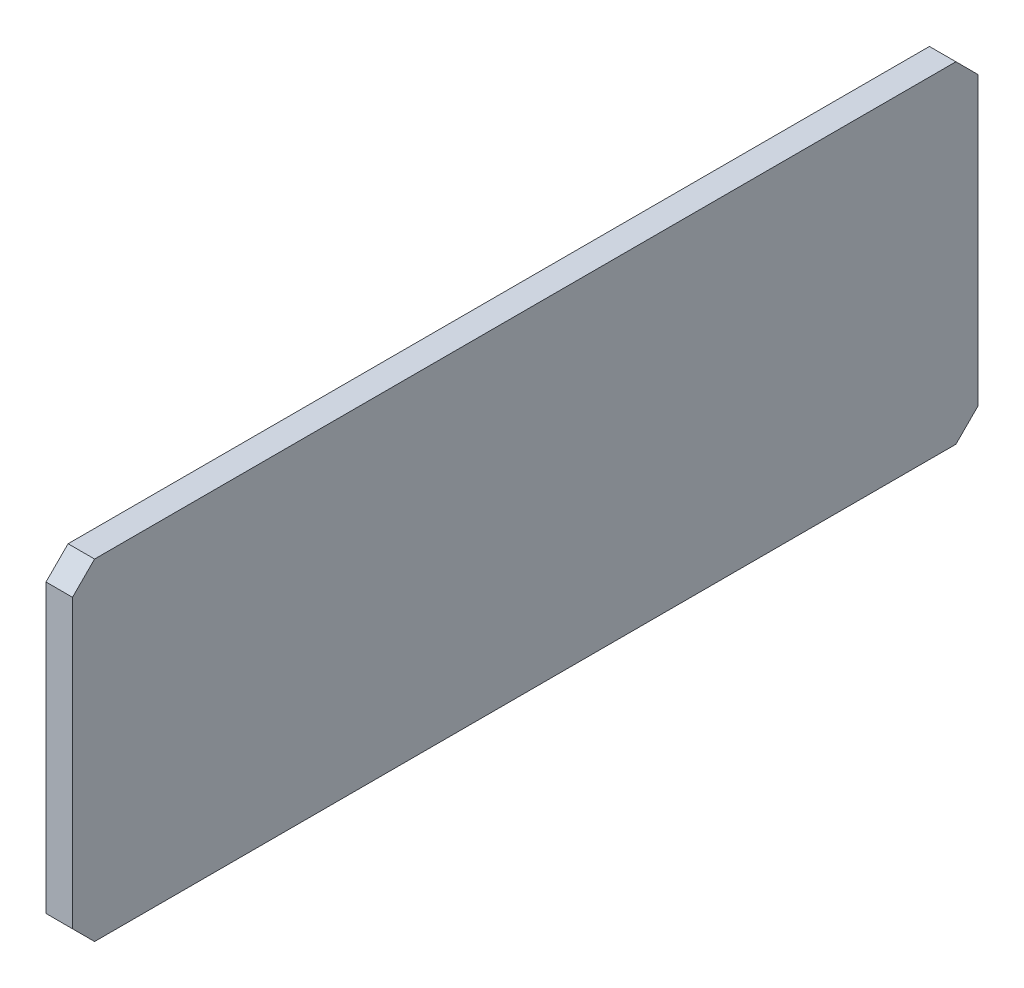
ISO-10303-21;
HEADER;
FILE_DESCRIPTION(('STEP AP214'),'2;1');
FILE_NAME('part.step','',(''),(''),'','','');
FILE_SCHEMA(('AUTOMOTIVE_DESIGN { 1 0 10303 214 1 1 1 1 }'));
ENDSEC;
DATA;
#1=APPLICATION_CONTEXT('core data for automotive mechanical design processes');
#2=APPLICATION_PROTOCOL_DEFINITION('international standard','automotive_design',2000,#1);
#3=PRODUCT_CONTEXT('',#1,'mechanical');
#4=PRODUCT('Part','Part','',(#3));
#5=PRODUCT_RELATED_PRODUCT_CATEGORY('part','',(#4));
#6=PRODUCT_DEFINITION_FORMATION('','',#4);
#7=PRODUCT_DEFINITION_CONTEXT('part definition',#1,'design');
#8=PRODUCT_DEFINITION('design','',#6,#7);
#9=PRODUCT_DEFINITION_SHAPE('','',#8);
#10=(LENGTH_UNIT() NAMED_UNIT(*) SI_UNIT(.MILLI.,.METRE.));
#11=(NAMED_UNIT(*) PLANE_ANGLE_UNIT() SI_UNIT($,.RADIAN.));
#12=(NAMED_UNIT(*) SI_UNIT($,.STERADIAN.) SOLID_ANGLE_UNIT());
#13=UNCERTAINTY_MEASURE_WITH_UNIT(LENGTH_MEASURE(1.E-05),#10,'distance_accuracy_value','');
#14=(GEOMETRIC_REPRESENTATION_CONTEXT(3) GLOBAL_UNCERTAINTY_ASSIGNED_CONTEXT((#13)) GLOBAL_UNIT_ASSIGNED_CONTEXT((#10,
#11,#12)) REPRESENTATION_CONTEXT('',''));
#15=CARTESIAN_POINT('',(0.,0.,0.));
#16=DIRECTION('',(0.,0.,1.));
#17=DIRECTION('',(1.,0.,0.));
#18=AXIS2_PLACEMENT_3D('',#15,#16,#17);
#19=CARTESIAN_POINT('',(5.99999999999978,-75.,410.000000000001));
#20=DIRECTION('',(-1.,0.,0.));
#21=DIRECTION('',(0.,0.,1.));
#22=AXIS2_PLACEMENT_3D('',#19,#20,#21);
#23=PLANE('',#22);
#24=DIRECTION('',(0.,1.,0.));
#25=VECTOR('',#24,1.);
#26=CARTESIAN_POINT('',(6.00000000000001,-75.,0.));
#27=LINE('',#26,#25);
#28=CARTESIAN_POINT('',(6.00000000000001,-64.9999999999999,0.));
#29=VERTEX_POINT('',#28);
#30=CARTESIAN_POINT('',(5.99999999999978,64.9999999999999,0.));
#31=VERTEX_POINT('',#30);
#32=EDGE_CURVE('E157',#29,#31,#27,.T.);
#33=ORIENTED_EDGE('',*,*,#32,.T.);
#34=DIRECTION('',(0.,0.70710678118655,0.707106781186546));
#35=VECTOR('',#34,1.);
#36=CARTESIAN_POINT('',(5.99999999999978,75.,10.));
#37=LINE('',#36,#35);
#38=CARTESIAN_POINT('',(5.99999999999978,75.,10.0000000000002));
#39=VERTEX_POINT('',#38);
#40=EDGE_CURVE('E142',#31,#39,#37,.T.);
#41=ORIENTED_EDGE('',*,*,#40,.T.);
#42=DIRECTION('',(0.,0.,-1.));
#43=VECTOR('',#42,1.);
#44=CARTESIAN_POINT('',(6.00000000000001,75.,410.000000000001));
#45=LINE('',#44,#43);
#46=CARTESIAN_POINT('',(6.00000000000001,75.,400.));
#47=VERTEX_POINT('',#46);
#48=EDGE_CURVE('E121',#47,#39,#45,.T.);
#49=ORIENTED_EDGE('',*,*,#48,.F.);
#50=DIRECTION('',(0.,0.707106781186546,-0.70710678118655));
#51=VECTOR('',#50,1.);
#52=CARTESIAN_POINT('',(6.00000000000001,64.9999999999999,410.000000000001));
#53=LINE('',#52,#51);
#54=CARTESIAN_POINT('',(6.00000000000001,64.9999999999999,410.000000000001));
#55=VERTEX_POINT('',#54);
#56=EDGE_CURVE('E125',#47,#55,#53,.F.);
#57=ORIENTED_EDGE('',*,*,#56,.T.);
#58=DIRECTION('',(0.,1.,0.));
#59=VECTOR('',#58,1.);
#60=CARTESIAN_POINT('',(5.99999999999978,-75.,410.000000000001));
#61=LINE('',#60,#59);
#62=CARTESIAN_POINT('',(5.99999999999978,-65.,410.000000000001));
#63=VERTEX_POINT('',#62);
#64=EDGE_CURVE('E151',#63,#55,#61,.T.);
#65=ORIENTED_EDGE('',*,*,#64,.F.);
#66=DIRECTION('',(0.,0.707106781186546,0.70710678118655));
#67=VECTOR('',#66,1.);
#68=CARTESIAN_POINT('',(5.99999999999978,-65.,410.000000000001));
#69=LINE('',#68,#67);
#70=CARTESIAN_POINT('',(5.99999999999978,-75.,400.));
#71=VERTEX_POINT('',#70);
#72=EDGE_CURVE('E57',#63,#71,#69,.F.);
#73=ORIENTED_EDGE('',*,*,#72,.T.);
#74=DIRECTION('',(0.,0.,-1.));
#75=VECTOR('',#74,1.);
#76=CARTESIAN_POINT('',(5.99999999999978,-75.,410.000000000001));
#77=LINE('',#76,#75);
#78=CARTESIAN_POINT('',(6.00000000000001,-75.,10.));
#79=VERTEX_POINT('',#78);
#80=EDGE_CURVE('E154',#71,#79,#77,.T.);
#81=ORIENTED_EDGE('',*,*,#80,.T.);
#82=DIRECTION('',(0.,0.70710678118655,-0.707106781186546));
#83=VECTOR('',#82,1.);
#84=CARTESIAN_POINT('',(6.00000000000001,-75.,10.));
#85=LINE('',#84,#83);
#86=EDGE_CURVE('E49',#79,#29,#85,.T.);
#87=ORIENTED_EDGE('',*,*,#86,.T.);
#88=EDGE_LOOP('',(#33,#41,#49,#57,#65,#73,#81,#87));
#89=FACE_BOUND('',#88,.T.);
#90=ADVANCED_FACE('F34',(#89),#23,.F.);
#91=CARTESIAN_POINT('',(-6.00000000000001,75.,410.000000000001));
#92=DIRECTION('',(0.,-1.,0.));
#93=DIRECTION('',(0.,0.,-1.));
#94=AXIS2_PLACEMENT_3D('',#91,#92,#93);
#95=PLANE('',#94);
#96=ORIENTED_EDGE('',*,*,#48,.T.);
#97=DIRECTION('',(-1.,0.,0.));
#98=VECTOR('',#97,1.);
#99=CARTESIAN_POINT('',(-6.00000000000023,75.,10.));
#100=LINE('',#99,#98);
#101=CARTESIAN_POINT('',(-6.00000000000023,75.,10.0000000000002));
#102=VERTEX_POINT('',#101);
#103=EDGE_CURVE('E112',#39,#102,#100,.T.);
#104=ORIENTED_EDGE('',*,*,#103,.T.);
#105=DIRECTION('',(0.,0.,-1.));
#106=VECTOR('',#105,1.);
#107=CARTESIAN_POINT('',(-6.00000000000001,75.,410.000000000001));
#108=LINE('',#107,#106);
#109=CARTESIAN_POINT('',(-6.00000000000001,75.,400.));
#110=VERTEX_POINT('',#109);
#111=EDGE_CURVE('E104',#110,#102,#108,.T.);
#112=ORIENTED_EDGE('',*,*,#111,.F.);
#113=DIRECTION('',(1.,0.,0.));
#114=VECTOR('',#113,1.);
#115=CARTESIAN_POINT('',(-6.00000000000001,75.,400.));
#116=LINE('',#115,#114);
#117=EDGE_CURVE('E118',#110,#47,#116,.T.);
#118=ORIENTED_EDGE('',*,*,#117,.T.);
#119=EDGE_LOOP('',(#96,#104,#112,#118));
#120=FACE_BOUND('',#119,.T.);
#121=ADVANCED_FACE('F117',(#120),#95,.F.);
#122=CARTESIAN_POINT('',(-6.00000000000012,-75.,410.000000000001));
#123=DIRECTION('',(1.,0.,0.));
#124=DIRECTION('',(0.,0.,-1.));
#125=AXIS2_PLACEMENT_3D('',#122,#123,#124);
#126=PLANE('',#125);
#127=ORIENTED_EDGE('',*,*,#111,.T.);
#128=DIRECTION('',(0.,-0.70710678118655,-0.707106781186546));
#129=VECTOR('',#128,1.);
#130=CARTESIAN_POINT('',(-6.00000000000023,75.,10.));
#131=LINE('',#130,#129);
#132=CARTESIAN_POINT('',(-6.00000000000023,64.9999999999999,0.));
#133=VERTEX_POINT('',#132);
#134=EDGE_CURVE('E133',#102,#133,#131,.T.);
#135=ORIENTED_EDGE('',*,*,#134,.T.);
#136=DIRECTION('',(0.,-1.,0.));
#137=VECTOR('',#136,1.);
#138=CARTESIAN_POINT('',(-6.00000000000001,-75.,0.));
#139=LINE('',#138,#137);
#140=CARTESIAN_POINT('',(-6.00000000000001,-64.9999999999999,0.));
#141=VERTEX_POINT('',#140);
#142=EDGE_CURVE('E152',#133,#141,#139,.T.);
#143=ORIENTED_EDGE('',*,*,#142,.T.);
#144=DIRECTION('',(0.,-0.70710678118655,0.707106781186546));
#145=VECTOR('',#144,1.);
#146=CARTESIAN_POINT('',(-6.00000000000001,-75.,10.));
#147=LINE('',#146,#145);
#148=CARTESIAN_POINT('',(-6.00000000000001,-75.,10.));
#149=VERTEX_POINT('',#148);
#150=EDGE_CURVE('E131',#141,#149,#147,.T.);
#151=ORIENTED_EDGE('',*,*,#150,.T.);
#152=DIRECTION('',(0.,0.,-1.));
#153=VECTOR('',#152,1.);
#154=CARTESIAN_POINT('',(-6.00000000000012,-75.,410.000000000001));
#155=LINE('',#154,#153);
#156=CARTESIAN_POINT('',(-6.00000000000012,-75.,400.));
#157=VERTEX_POINT('',#156);
#158=EDGE_CURVE('E122',#157,#149,#155,.T.);
#159=ORIENTED_EDGE('',*,*,#158,.F.);
#160=DIRECTION('',(0.,-0.707106781186546,-0.70710678118655));
#161=VECTOR('',#160,1.);
#162=CARTESIAN_POINT('',(-6.00000000000012,-65.,410.000000000001));
#163=LINE('',#162,#161);
#164=CARTESIAN_POINT('',(-6.00000000000012,-65.,410.000000000001));
#165=VERTEX_POINT('',#164);
#166=EDGE_CURVE('E111',#157,#165,#163,.F.);
#167=ORIENTED_EDGE('',*,*,#166,.T.);
#168=DIRECTION('',(0.,-1.,0.));
#169=VECTOR('',#168,1.);
#170=CARTESIAN_POINT('',(-6.00000000000012,-75.,410.000000000001));
#171=LINE('',#170,#169);
#172=CARTESIAN_POINT('',(-6.00000000000001,64.9999999999999,410.000000000001));
#173=VERTEX_POINT('',#172);
#174=EDGE_CURVE('E106',#173,#165,#171,.T.);
#175=ORIENTED_EDGE('',*,*,#174,.F.);
#176=DIRECTION('',(0.,-0.707106781186546,0.70710678118655));
#177=VECTOR('',#176,1.);
#178=CARTESIAN_POINT('',(-6.00000000000001,64.9999999999999,410.000000000001));
#179=LINE('',#178,#177);
#180=EDGE_CURVE('E101',#173,#110,#179,.F.);
#181=ORIENTED_EDGE('',*,*,#180,.T.);
#182=EDGE_LOOP('',(#127,#135,#143,#151,#159,#167,#175,#181));
#183=FACE_BOUND('',#182,.T.);
#184=ADVANCED_FACE('F103',(#183),#126,.F.);
#185=CARTESIAN_POINT('',(-6.00000000000012,-75.,410.000000000001));
#186=DIRECTION('',(0.,1.,0.));
#187=DIRECTION('',(0.,0.,1.));
#188=AXIS2_PLACEMENT_3D('',#185,#186,#187);
#189=PLANE('',#188);
#190=ORIENTED_EDGE('',*,*,#158,.T.);
#191=DIRECTION('',(1.,0.,0.));
#192=VECTOR('',#191,1.);
#193=CARTESIAN_POINT('',(6.00000000000001,-75.,10.));
#194=LINE('',#193,#192);
#195=EDGE_CURVE('E146',#149,#79,#194,.T.);
#196=ORIENTED_EDGE('',*,*,#195,.T.);
#197=ORIENTED_EDGE('',*,*,#80,.F.);
#198=DIRECTION('',(-1.,0.,0.));
#199=VECTOR('',#198,1.);
#200=CARTESIAN_POINT('',(-6.00000000000012,-75.,400.));
#201=LINE('',#200,#199);
#202=EDGE_CURVE('E144',#71,#157,#201,.T.);
#203=ORIENTED_EDGE('',*,*,#202,.T.);
#204=EDGE_LOOP('',(#190,#196,#197,#203));
#205=FACE_BOUND('',#204,.T.);
#206=ADVANCED_FACE('F166',(#205),#189,.F.);
#207=CARTESIAN_POINT('',(0.,0.,410.000000000001));
#208=DIRECTION('',(0.,0.,-1.));
#209=DIRECTION('',(-1.,0.,0.));
#210=AXIS2_PLACEMENT_3D('',#207,#208,#209);
#211=PLANE('',#210);
#212=ORIENTED_EDGE('',*,*,#174,.T.);
#213=DIRECTION('',(1.,0.,0.));
#214=VECTOR('',#213,1.);
#215=CARTESIAN_POINT('',(-2.22044604925031E-13,-65.,410.000000000001));
#216=LINE('',#215,#214);
#217=EDGE_CURVE('E11',#165,#63,#216,.T.);
#218=ORIENTED_EDGE('',*,*,#217,.T.);
#219=ORIENTED_EDGE('',*,*,#64,.T.);
#220=DIRECTION('',(-1.,0.,0.));
#221=VECTOR('',#220,1.);
#222=CARTESIAN_POINT('',(0.,64.9999999999999,410.000000000001));
#223=LINE('',#222,#221);
#224=EDGE_CURVE('E42',#55,#173,#223,.T.);
#225=ORIENTED_EDGE('',*,*,#224,.T.);
#226=EDGE_LOOP('',(#212,#218,#219,#225));
#227=FACE_BOUND('',#226,.T.);
#228=ADVANCED_FACE('F149',(#227),#211,.F.);
#229=CARTESIAN_POINT('',(0.,0.,0.));
#230=DIRECTION('',(0.,0.,-1.));
#231=DIRECTION('',(-1.,0.,0.));
#232=AXIS2_PLACEMENT_3D('',#229,#230,#231);
#233=PLANE('',#232);
#234=ORIENTED_EDGE('',*,*,#142,.F.);
#235=DIRECTION('',(1.,0.,0.));
#236=VECTOR('',#235,1.);
#237=CARTESIAN_POINT('',(5.99999999999978,64.9999999999999,0.));
#238=LINE('',#237,#236);
#239=EDGE_CURVE('E137',#133,#31,#238,.T.);
#240=ORIENTED_EDGE('',*,*,#239,.T.);
#241=ORIENTED_EDGE('',*,*,#32,.F.);
#242=DIRECTION('',(-1.,0.,0.));
#243=VECTOR('',#242,1.);
#244=CARTESIAN_POINT('',(-6.00000000000001,-64.9999999999999,0.));
#245=LINE('',#244,#243);
#246=EDGE_CURVE('E135',#29,#141,#245,.T.);
#247=ORIENTED_EDGE('',*,*,#246,.T.);
#248=EDGE_LOOP('',(#234,#240,#241,#247));
#249=FACE_BOUND('',#248,.T.);
#250=ADVANCED_FACE('F174',(#249),#233,.T.);
#251=CARTESIAN_POINT('',(-6.00000000000023,75.,10.));
#252=DIRECTION('',(0.,0.707106781186545,-0.70710678118655));
#253=DIRECTION('',(1.,0.,0.));
#254=AXIS2_PLACEMENT_3D('',#251,#252,#253);
#255=PLANE('',#254);
#256=ORIENTED_EDGE('',*,*,#40,.F.);
#257=ORIENTED_EDGE('',*,*,#239,.F.);
#258=ORIENTED_EDGE('',*,*,#134,.F.);
#259=ORIENTED_EDGE('',*,*,#103,.F.);
#260=EDGE_LOOP('',(#256,#257,#258,#259));
#261=FACE_BOUND('',#260,.T.);
#262=ADVANCED_FACE('F178',(#261),#255,.T.);
#263=CARTESIAN_POINT('',(-6.00000000000001,-75.,10.));
#264=DIRECTION('',(0.,-0.707106781186545,-0.70710678118655));
#265=DIRECTION('',(-1.,0.,0.));
#266=AXIS2_PLACEMENT_3D('',#263,#264,#265);
#267=PLANE('',#266);
#268=ORIENTED_EDGE('',*,*,#150,.F.);
#269=ORIENTED_EDGE('',*,*,#246,.F.);
#270=ORIENTED_EDGE('',*,*,#86,.F.);
#271=ORIENTED_EDGE('',*,*,#195,.F.);
#272=EDGE_LOOP('',(#268,#269,#270,#271));
#273=FACE_BOUND('',#272,.T.);
#274=ADVANCED_FACE('F170',(#273),#267,.T.);
#275=CARTESIAN_POINT('',(-2.22044604925031E-13,-65.,410.000000000001));
#276=DIRECTION('',(0.,0.707106781186549,-0.707106781186546));
#277=DIRECTION('',(1.,0.,0.));
#278=AXIS2_PLACEMENT_3D('',#275,#276,#277);
#279=PLANE('',#278);
#280=ORIENTED_EDGE('',*,*,#166,.F.);
#281=ORIENTED_EDGE('',*,*,#202,.F.);
#282=ORIENTED_EDGE('',*,*,#72,.F.);
#283=ORIENTED_EDGE('',*,*,#217,.F.);
#284=EDGE_LOOP('',(#280,#281,#282,#283));
#285=FACE_BOUND('',#284,.T.);
#286=ADVANCED_FACE('F180',(#285),#279,.F.);
#287=CARTESIAN_POINT('',(0.,64.9999999999999,410.000000000001));
#288=DIRECTION('',(0.,-0.707106781186549,-0.707106781186546));
#289=DIRECTION('',(-1.,0.,0.));
#290=AXIS2_PLACEMENT_3D('',#287,#288,#289);
#291=PLANE('',#290);
#292=ORIENTED_EDGE('',*,*,#56,.F.);
#293=ORIENTED_EDGE('',*,*,#117,.F.);
#294=ORIENTED_EDGE('',*,*,#180,.F.);
#295=ORIENTED_EDGE('',*,*,#224,.F.);
#296=EDGE_LOOP('',(#292,#293,#294,#295));
#297=FACE_BOUND('',#296,.T.);
#298=ADVANCED_FACE('F36',(#297),#291,.F.);
#299=CLOSED_SHELL('',(#90,#121,#184,#206,#228,#250,#262,#274,#286,#298));
#300=MANIFOLD_SOLID_BREP('B2',#299);
#301=ADVANCED_BREP_SHAPE_REPRESENTATION('',(#18,#300),#14);
#302=SHAPE_DEFINITION_REPRESENTATION(#9,#301);
ENDSEC;
END-ISO-10303-21;
